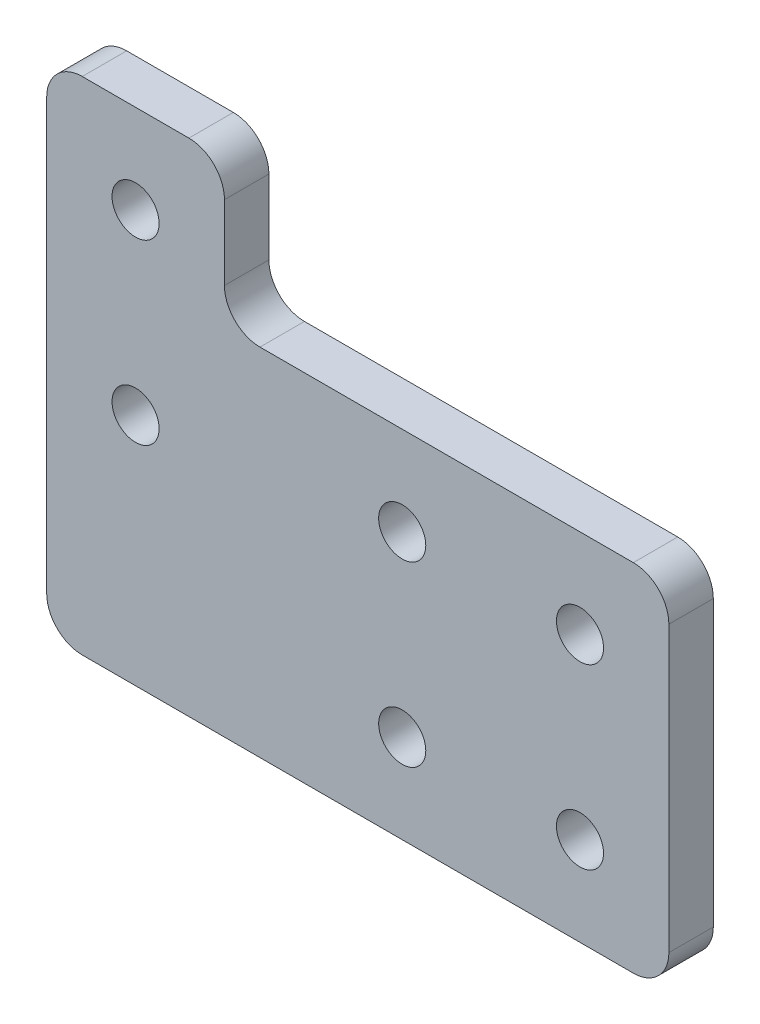
ISO-10303-21;
HEADER;
FILE_DESCRIPTION(('STEP AP214'),'2;1');
FILE_NAME('part.step','',(''),(''),'','','');
FILE_SCHEMA(('AUTOMOTIVE_DESIGN { 1 0 10303 214 1 1 1 1 }'));
ENDSEC;
DATA;
#1=APPLICATION_CONTEXT('core data for automotive mechanical design processes');
#2=APPLICATION_PROTOCOL_DEFINITION('international standard','automotive_design',2000,#1);
#3=PRODUCT_CONTEXT('',#1,'mechanical');
#4=PRODUCT('Part','Part','',(#3));
#5=PRODUCT_RELATED_PRODUCT_CATEGORY('part','',(#4));
#6=PRODUCT_DEFINITION_FORMATION('','',#4);
#7=PRODUCT_DEFINITION_CONTEXT('part definition',#1,'design');
#8=PRODUCT_DEFINITION('design','',#6,#7);
#9=PRODUCT_DEFINITION_SHAPE('','',#8);
#10=(LENGTH_UNIT() NAMED_UNIT(*) SI_UNIT(.MILLI.,.METRE.));
#11=(NAMED_UNIT(*) PLANE_ANGLE_UNIT() SI_UNIT($,.RADIAN.));
#12=(NAMED_UNIT(*) SI_UNIT($,.STERADIAN.) SOLID_ANGLE_UNIT());
#13=UNCERTAINTY_MEASURE_WITH_UNIT(LENGTH_MEASURE(1.E-05),#10,'distance_accuracy_value','');
#14=(GEOMETRIC_REPRESENTATION_CONTEXT(3) GLOBAL_UNCERTAINTY_ASSIGNED_CONTEXT((#13)) GLOBAL_UNIT_ASSIGNED_CONTEXT((#10,
#11,#12)) REPRESENTATION_CONTEXT('',''));
#15=CARTESIAN_POINT('',(0.,0.,0.));
#16=DIRECTION('',(0.,0.,1.));
#17=DIRECTION('',(1.,0.,0.));
#18=AXIS2_PLACEMENT_3D('',#15,#16,#17);
#19=CARTESIAN_POINT('',(-26.,24.,5.));
#20=DIRECTION('',(0.,0.,-1.));
#21=DIRECTION('',(-1.,0.,0.));
#22=AXIS2_PLACEMENT_3D('',#19,#20,#21);
#23=PLANE('',#22);
#24=CARTESIAN_POINT('',(-26.,24.,5.));
#25=DIRECTION('',(0.,0.,-1.));
#26=DIRECTION('',(-1.,0.,0.));
#27=AXIS2_PLACEMENT_3D('',#24,#25,#26);
#28=CIRCLE('',#27,4.00000000000001);
#29=CARTESIAN_POINT('',(-26.,20.,5.));
#30=VERTEX_POINT('',#29);
#31=CARTESIAN_POINT('',(-30.,24.,5.));
#32=VERTEX_POINT('',#31);
#33=EDGE_CURVE('E181',#30,#32,#28,.T.);
#34=ORIENTED_EDGE('',*,*,#33,.T.);
#35=DIRECTION('',(0.,1.,0.));
#36=VECTOR('',#35,1.);
#37=CARTESIAN_POINT('',(-30.,24.,5.));
#38=LINE('',#37,#36);
#39=CARTESIAN_POINT('',(-30.,32.365,5.));
#40=VERTEX_POINT('',#39);
#41=EDGE_CURVE('E108',#32,#40,#38,.T.);
#42=ORIENTED_EDGE('',*,*,#41,.T.);
#43=CARTESIAN_POINT('',(-34.,32.365,5.));
#44=DIRECTION('',(0.,0.,1.));
#45=DIRECTION('',(1.,0.,0.));
#46=AXIS2_PLACEMENT_3D('',#43,#44,#45);
#47=CIRCLE('',#46,4.00000000000001);
#48=CARTESIAN_POINT('',(-34.,36.365,5.));
#49=VERTEX_POINT('',#48);
#50=EDGE_CURVE('E208',#40,#49,#47,.T.);
#51=ORIENTED_EDGE('',*,*,#50,.T.);
#52=DIRECTION('',(-1.,0.,0.));
#53=VECTOR('',#52,1.);
#54=CARTESIAN_POINT('',(-34.,36.365,5.));
#55=LINE('',#54,#53);
#56=CARTESIAN_POINT('',(-46.,36.365,5.));
#57=VERTEX_POINT('',#56);
#58=EDGE_CURVE('E227',#49,#57,#55,.T.);
#59=ORIENTED_EDGE('',*,*,#58,.T.);
#60=CARTESIAN_POINT('',(-46.,32.365,5.));
#61=DIRECTION('',(0.,0.,1.));
#62=DIRECTION('',(1.,0.,0.));
#63=AXIS2_PLACEMENT_3D('',#60,#61,#62);
#64=CIRCLE('',#63,4.00000000000001);
#65=CARTESIAN_POINT('',(-50.,32.365,5.));
#66=VERTEX_POINT('',#65);
#67=EDGE_CURVE('E224',#57,#66,#64,.T.);
#68=ORIENTED_EDGE('',*,*,#67,.T.);
#69=DIRECTION('',(0.,-1.,0.));
#70=VECTOR('',#69,1.);
#71=CARTESIAN_POINT('',(-50.,32.365,5.));
#72=LINE('',#71,#70);
#73=CARTESIAN_POINT('',(-50.,-16.,5.));
#74=VERTEX_POINT('',#73);
#75=EDGE_CURVE('E226',#66,#74,#72,.T.);
#76=ORIENTED_EDGE('',*,*,#75,.T.);
#77=CARTESIAN_POINT('',(-46.,-16.,5.));
#78=DIRECTION('',(0.,0.,1.));
#79=DIRECTION('',(1.,0.,0.));
#80=AXIS2_PLACEMENT_3D('',#77,#78,#79);
#81=CIRCLE('',#80,4.00000000000001);
#82=CARTESIAN_POINT('',(-46.,-20.,5.));
#83=VERTEX_POINT('',#82);
#84=EDGE_CURVE('E229',#74,#83,#81,.T.);
#85=ORIENTED_EDGE('',*,*,#84,.T.);
#86=DIRECTION('',(1.,0.,0.));
#87=VECTOR('',#86,1.);
#88=CARTESIAN_POINT('',(-46.,-20.,5.));
#89=LINE('',#88,#87);
#90=CARTESIAN_POINT('',(16.,-20.,5.));
#91=VERTEX_POINT('',#90);
#92=EDGE_CURVE('E235',#83,#91,#89,.T.);
#93=ORIENTED_EDGE('',*,*,#92,.T.);
#94=CARTESIAN_POINT('',(16.,-16.,5.));
#95=DIRECTION('',(0.,0.,1.));
#96=DIRECTION('',(1.,0.,0.));
#97=AXIS2_PLACEMENT_3D('',#94,#95,#96);
#98=CIRCLE('',#97,4.);
#99=CARTESIAN_POINT('',(20.,-16.,5.));
#100=VERTEX_POINT('',#99);
#101=EDGE_CURVE('E139',#91,#100,#98,.T.);
#102=ORIENTED_EDGE('',*,*,#101,.T.);
#103=DIRECTION('',(0.,1.,0.));
#104=VECTOR('',#103,1.);
#105=CARTESIAN_POINT('',(20.,-16.,5.));
#106=LINE('',#105,#104);
#107=CARTESIAN_POINT('',(20.,16.,5.));
#108=VERTEX_POINT('',#107);
#109=EDGE_CURVE('E133',#100,#108,#106,.T.);
#110=ORIENTED_EDGE('',*,*,#109,.T.);
#111=CARTESIAN_POINT('',(16.,16.,5.));
#112=DIRECTION('',(0.,0.,1.));
#113=DIRECTION('',(1.,0.,0.));
#114=AXIS2_PLACEMENT_3D('',#111,#112,#113);
#115=CIRCLE('',#114,4.);
#116=CARTESIAN_POINT('',(16.,20.,5.));
#117=VERTEX_POINT('',#116);
#118=EDGE_CURVE('E137',#108,#117,#115,.T.);
#119=ORIENTED_EDGE('',*,*,#118,.T.);
#120=DIRECTION('',(-1.,0.,0.));
#121=VECTOR('',#120,1.);
#122=CARTESIAN_POINT('',(16.,20.,5.));
#123=LINE('',#122,#121);
#124=EDGE_CURVE('E53',#117,#30,#123,.T.);
#125=ORIENTED_EDGE('',*,*,#124,.T.);
#126=EDGE_LOOP('',(#34,#42,#51,#59,#68,#76,#85,#93,#102,#110,#119,#125));
#127=FACE_BOUND('',#126,.T.);
#128=CARTESIAN_POINT('',(-10.,10.,5.));
#129=DIRECTION('',(0.,0.,1.));
#130=DIRECTION('',(1.,0.,0.));
#131=AXIS2_PLACEMENT_3D('',#128,#129,#130);
#132=CIRCLE('',#131,2.65);
#133=CARTESIAN_POINT('',(-7.35,10.,5.));
#134=VERTEX_POINT('',#133);
#135=EDGE_CURVE('E162',#134,#134,#132,.T.);
#136=ORIENTED_EDGE('',*,*,#135,.F.);
#137=EDGE_LOOP('',(#136));
#138=FACE_BOUND('',#137,.T.);
#139=CARTESIAN_POINT('',(-10.,-10.,5.));
#140=DIRECTION('',(0.,0.,1.));
#141=DIRECTION('',(1.,0.,0.));
#142=AXIS2_PLACEMENT_3D('',#139,#140,#141);
#143=CIRCLE('',#142,2.65);
#144=CARTESIAN_POINT('',(-7.35,-10.,5.));
#145=VERTEX_POINT('',#144);
#146=EDGE_CURVE('E319',#145,#145,#143,.T.);
#147=ORIENTED_EDGE('',*,*,#146,.F.);
#148=EDGE_LOOP('',(#147));
#149=FACE_BOUND('',#148,.T.);
#150=CARTESIAN_POINT('',(10.,10.,5.));
#151=DIRECTION('',(0.,0.,1.));
#152=DIRECTION('',(1.,0.,0.));
#153=AXIS2_PLACEMENT_3D('',#150,#151,#152);
#154=CIRCLE('',#153,2.65);
#155=CARTESIAN_POINT('',(12.65,10.,5.));
#156=VERTEX_POINT('',#155);
#157=EDGE_CURVE('E313',#156,#156,#154,.T.);
#158=ORIENTED_EDGE('',*,*,#157,.F.);
#159=EDGE_LOOP('',(#158));
#160=FACE_BOUND('',#159,.T.);
#161=CARTESIAN_POINT('',(10.,-10.,5.));
#162=DIRECTION('',(0.,0.,1.));
#163=DIRECTION('',(1.,0.,0.));
#164=AXIS2_PLACEMENT_3D('',#161,#162,#163);
#165=CIRCLE('',#164,2.65000000000001);
#166=CARTESIAN_POINT('',(12.65,-10.,5.));
#167=VERTEX_POINT('',#166);
#168=EDGE_CURVE('E307',#167,#167,#165,.T.);
#169=ORIENTED_EDGE('',*,*,#168,.F.);
#170=EDGE_LOOP('',(#169));
#171=FACE_BOUND('',#170,.T.);
#172=CARTESIAN_POINT('',(-40.,26.365,5.));
#173=DIRECTION('',(0.,0.,1.));
#174=DIRECTION('',(1.,0.,0.));
#175=AXIS2_PLACEMENT_3D('',#172,#173,#174);
#176=CIRCLE('',#175,2.65);
#177=CARTESIAN_POINT('',(-37.35,26.365,5.));
#178=VERTEX_POINT('',#177);
#179=EDGE_CURVE('E301',#178,#178,#176,.T.);
#180=ORIENTED_EDGE('',*,*,#179,.F.);
#181=EDGE_LOOP('',(#180));
#182=FACE_BOUND('',#181,.T.);
#183=CARTESIAN_POINT('',(-40.,6.36499999999999,5.));
#184=DIRECTION('',(0.,0.,1.));
#185=DIRECTION('',(1.,0.,0.));
#186=AXIS2_PLACEMENT_3D('',#183,#184,#185);
#187=CIRCLE('',#186,2.65);
#188=CARTESIAN_POINT('',(-37.35,6.36499999999999,5.));
#189=VERTEX_POINT('',#188);
#190=EDGE_CURVE('E292',#189,#189,#187,.T.);
#191=ORIENTED_EDGE('',*,*,#190,.F.);
#192=EDGE_LOOP('',(#191));
#193=FACE_BOUND('',#192,.T.);
#194=ADVANCED_FACE('F36',(#127,#138,#149,#160,#171,#182,#193),#23,.F.);
#195=CARTESIAN_POINT('',(-26.,24.,0.));
#196=DIRECTION('',(0.,0.,-1.));
#197=DIRECTION('',(-1.,0.,0.));
#198=AXIS2_PLACEMENT_3D('',#195,#196,#197);
#199=PLANE('',#198);
#200=CARTESIAN_POINT('',(-40.,26.365,0.));
#201=DIRECTION('',(0.,0.,1.));
#202=DIRECTION('',(1.,0.,0.));
#203=AXIS2_PLACEMENT_3D('',#200,#201,#202);
#204=CIRCLE('',#203,2.65);
#205=CARTESIAN_POINT('',(-37.35,26.365,0.));
#206=VERTEX_POINT('',#205);
#207=EDGE_CURVE('E298',#206,#206,#204,.T.);
#208=ORIENTED_EDGE('',*,*,#207,.T.);
#209=EDGE_LOOP('',(#208));
#210=FACE_BOUND('',#209,.T.);
#211=CARTESIAN_POINT('',(10.,10.,0.));
#212=DIRECTION('',(0.,0.,1.));
#213=DIRECTION('',(1.,0.,0.));
#214=AXIS2_PLACEMENT_3D('',#211,#212,#213);
#215=CIRCLE('',#214,2.65);
#216=CARTESIAN_POINT('',(12.65,10.,0.));
#217=VERTEX_POINT('',#216);
#218=EDGE_CURVE('E310',#217,#217,#215,.T.);
#219=ORIENTED_EDGE('',*,*,#218,.T.);
#220=EDGE_LOOP('',(#219));
#221=FACE_BOUND('',#220,.T.);
#222=CARTESIAN_POINT('',(-10.,10.,0.));
#223=DIRECTION('',(0.,0.,1.));
#224=DIRECTION('',(1.,0.,0.));
#225=AXIS2_PLACEMENT_3D('',#222,#223,#224);
#226=CIRCLE('',#225,2.65);
#227=CARTESIAN_POINT('',(-7.35,10.,0.));
#228=VERTEX_POINT('',#227);
#229=EDGE_CURVE('E322',#228,#228,#226,.T.);
#230=ORIENTED_EDGE('',*,*,#229,.T.);
#231=EDGE_LOOP('',(#230));
#232=FACE_BOUND('',#231,.T.);
#233=CARTESIAN_POINT('',(-26.,24.,0.));
#234=DIRECTION('',(0.,0.,-1.));
#235=DIRECTION('',(-1.,0.,0.));
#236=AXIS2_PLACEMENT_3D('',#233,#234,#235);
#237=CIRCLE('',#236,4.00000000000001);
#238=CARTESIAN_POINT('',(-26.,20.,0.));
#239=VERTEX_POINT('',#238);
#240=CARTESIAN_POINT('',(-30.,24.,0.));
#241=VERTEX_POINT('',#240);
#242=EDGE_CURVE('E158',#239,#241,#237,.T.);
#243=ORIENTED_EDGE('',*,*,#242,.F.);
#244=DIRECTION('',(-1.,0.,0.));
#245=VECTOR('',#244,1.);
#246=CARTESIAN_POINT('',(16.,20.,0.));
#247=LINE('',#246,#245);
#248=CARTESIAN_POINT('',(16.,20.,0.));
#249=VERTEX_POINT('',#248);
#250=EDGE_CURVE('E100',#249,#239,#247,.T.);
#251=ORIENTED_EDGE('',*,*,#250,.F.);
#252=CARTESIAN_POINT('',(16.,16.,0.));
#253=DIRECTION('',(0.,0.,1.));
#254=DIRECTION('',(1.,0.,0.));
#255=AXIS2_PLACEMENT_3D('',#252,#253,#254);
#256=CIRCLE('',#255,4.);
#257=CARTESIAN_POINT('',(20.,16.,0.));
#258=VERTEX_POINT('',#257);
#259=EDGE_CURVE('E94',#258,#249,#256,.T.);
#260=ORIENTED_EDGE('',*,*,#259,.F.);
#261=DIRECTION('',(0.,1.,0.));
#262=VECTOR('',#261,1.);
#263=CARTESIAN_POINT('',(20.,-16.,0.));
#264=LINE('',#263,#262);
#265=CARTESIAN_POINT('',(20.,-16.,0.));
#266=VERTEX_POINT('',#265);
#267=EDGE_CURVE('E147',#266,#258,#264,.T.);
#268=ORIENTED_EDGE('',*,*,#267,.F.);
#269=CARTESIAN_POINT('',(16.,-16.,0.));
#270=DIRECTION('',(0.,0.,1.));
#271=DIRECTION('',(1.,0.,0.));
#272=AXIS2_PLACEMENT_3D('',#269,#270,#271);
#273=CIRCLE('',#272,4.);
#274=CARTESIAN_POINT('',(16.,-20.,0.));
#275=VERTEX_POINT('',#274);
#276=EDGE_CURVE('E176',#275,#266,#273,.T.);
#277=ORIENTED_EDGE('',*,*,#276,.F.);
#278=DIRECTION('',(1.,0.,0.));
#279=VECTOR('',#278,1.);
#280=CARTESIAN_POINT('',(-46.,-20.,0.));
#281=LINE('',#280,#279);
#282=CARTESIAN_POINT('',(-46.,-20.,0.));
#283=VERTEX_POINT('',#282);
#284=EDGE_CURVE('E174',#283,#275,#281,.T.);
#285=ORIENTED_EDGE('',*,*,#284,.F.);
#286=CARTESIAN_POINT('',(-46.,-16.,0.));
#287=DIRECTION('',(0.,0.,1.));
#288=DIRECTION('',(1.,0.,0.));
#289=AXIS2_PLACEMENT_3D('',#286,#287,#288);
#290=CIRCLE('',#289,4.00000000000001);
#291=CARTESIAN_POINT('',(-50.,-16.,0.));
#292=VERTEX_POINT('',#291);
#293=EDGE_CURVE('E172',#292,#283,#290,.T.);
#294=ORIENTED_EDGE('',*,*,#293,.F.);
#295=DIRECTION('',(0.,-1.,0.));
#296=VECTOR('',#295,1.);
#297=CARTESIAN_POINT('',(-50.,32.365,0.));
#298=LINE('',#297,#296);
#299=CARTESIAN_POINT('',(-50.,32.365,0.));
#300=VERTEX_POINT('',#299);
#301=EDGE_CURVE('E170',#300,#292,#298,.T.);
#302=ORIENTED_EDGE('',*,*,#301,.F.);
#303=CARTESIAN_POINT('',(-46.,32.365,0.));
#304=DIRECTION('',(0.,0.,1.));
#305=DIRECTION('',(1.,0.,0.));
#306=AXIS2_PLACEMENT_3D('',#303,#304,#305);
#307=CIRCLE('',#306,4.00000000000001);
#308=CARTESIAN_POINT('',(-46.,36.365,0.));
#309=VERTEX_POINT('',#308);
#310=EDGE_CURVE('E168',#309,#300,#307,.T.);
#311=ORIENTED_EDGE('',*,*,#310,.F.);
#312=DIRECTION('',(-1.,0.,0.));
#313=VECTOR('',#312,1.);
#314=CARTESIAN_POINT('',(-34.,36.365,0.));
#315=LINE('',#314,#313);
#316=CARTESIAN_POINT('',(-34.,36.365,0.));
#317=VERTEX_POINT('',#316);
#318=EDGE_CURVE('E166',#317,#309,#315,.T.);
#319=ORIENTED_EDGE('',*,*,#318,.F.);
#320=CARTESIAN_POINT('',(-34.,32.365,0.));
#321=DIRECTION('',(0.,0.,1.));
#322=DIRECTION('',(1.,0.,0.));
#323=AXIS2_PLACEMENT_3D('',#320,#321,#322);
#324=CIRCLE('',#323,4.00000000000001);
#325=CARTESIAN_POINT('',(-30.,32.365,0.));
#326=VERTEX_POINT('',#325);
#327=EDGE_CURVE('E164',#326,#317,#324,.T.);
#328=ORIENTED_EDGE('',*,*,#327,.F.);
#329=DIRECTION('',(0.,1.,0.));
#330=VECTOR('',#329,1.);
#331=CARTESIAN_POINT('',(-30.,24.,0.));
#332=LINE('',#331,#330);
#333=EDGE_CURVE('E161',#241,#326,#332,.T.);
#334=ORIENTED_EDGE('',*,*,#333,.F.);
#335=EDGE_LOOP('',(#243,#251,#260,#268,#277,#285,#294,#302,#311,#319,#328,#334));
#336=FACE_BOUND('',#335,.T.);
#337=CARTESIAN_POINT('',(-10.,-10.,0.));
#338=DIRECTION('',(0.,0.,1.));
#339=DIRECTION('',(1.,0.,0.));
#340=AXIS2_PLACEMENT_3D('',#337,#338,#339);
#341=CIRCLE('',#340,2.65);
#342=CARTESIAN_POINT('',(-7.35,-10.,0.));
#343=VERTEX_POINT('',#342);
#344=EDGE_CURVE('E316',#343,#343,#341,.T.);
#345=ORIENTED_EDGE('',*,*,#344,.T.);
#346=EDGE_LOOP('',(#345));
#347=FACE_BOUND('',#346,.T.);
#348=CARTESIAN_POINT('',(10.,-10.,0.));
#349=DIRECTION('',(0.,0.,1.));
#350=DIRECTION('',(1.,0.,0.));
#351=AXIS2_PLACEMENT_3D('',#348,#349,#350);
#352=CIRCLE('',#351,2.65000000000001);
#353=CARTESIAN_POINT('',(12.65,-10.,0.));
#354=VERTEX_POINT('',#353);
#355=EDGE_CURVE('E304',#354,#354,#352,.T.);
#356=ORIENTED_EDGE('',*,*,#355,.T.);
#357=EDGE_LOOP('',(#356));
#358=FACE_BOUND('',#357,.T.);
#359=CARTESIAN_POINT('',(-40.,6.36499999999999,0.));
#360=DIRECTION('',(0.,0.,1.));
#361=DIRECTION('',(1.,0.,0.));
#362=AXIS2_PLACEMENT_3D('',#359,#360,#361);
#363=CIRCLE('',#362,2.65);
#364=CARTESIAN_POINT('',(-37.35,6.36499999999999,0.));
#365=VERTEX_POINT('',#364);
#366=EDGE_CURVE('E295',#365,#365,#363,.T.);
#367=ORIENTED_EDGE('',*,*,#366,.T.);
#368=EDGE_LOOP('',(#367));
#369=FACE_BOUND('',#368,.T.);
#370=ADVANCED_FACE('F212',(#210,#221,#232,#336,#347,#358,#369),#199,.T.);
#371=CARTESIAN_POINT('',(-26.,24.,5.));
#372=DIRECTION('',(0.,0.,-1.));
#373=DIRECTION('',(-1.,0.,0.));
#374=AXIS2_PLACEMENT_3D('',#371,#372,#373);
#375=CYLINDRICAL_SURFACE('',#374,4.00000000000001);
#376=ORIENTED_EDGE('',*,*,#242,.T.);
#377=DIRECTION('',(0.,0.,-1.));
#378=VECTOR('',#377,1.);
#379=CARTESIAN_POINT('',(-30.,24.,5.));
#380=LINE('',#379,#378);
#381=EDGE_CURVE('E11',#32,#241,#380,.T.);
#382=ORIENTED_EDGE('',*,*,#381,.F.);
#383=ORIENTED_EDGE('',*,*,#33,.F.);
#384=DIRECTION('',(0.,0.,-1.));
#385=VECTOR('',#384,1.);
#386=CARTESIAN_POINT('',(-26.,20.,5.));
#387=LINE('',#386,#385);
#388=EDGE_CURVE('E154',#30,#239,#387,.T.);
#389=ORIENTED_EDGE('',*,*,#388,.T.);
#390=EDGE_LOOP('',(#376,#382,#383,#389));
#391=FACE_BOUND('',#390,.T.);
#392=ADVANCED_FACE('F38',(#391),#375,.F.);
#393=CARTESIAN_POINT('',(-30.,24.,5.));
#394=DIRECTION('',(-1.,0.,0.));
#395=DIRECTION('',(0.,-1.,0.));
#396=AXIS2_PLACEMENT_3D('',#393,#394,#395);
#397=PLANE('',#396);
#398=ORIENTED_EDGE('',*,*,#333,.T.);
#399=DIRECTION('',(0.,0.,-1.));
#400=VECTOR('',#399,1.);
#401=CARTESIAN_POINT('',(-30.,32.365,5.));
#402=LINE('',#401,#400);
#403=EDGE_CURVE('E45',#40,#326,#402,.T.);
#404=ORIENTED_EDGE('',*,*,#403,.F.);
#405=ORIENTED_EDGE('',*,*,#41,.F.);
#406=ORIENTED_EDGE('',*,*,#381,.T.);
#407=EDGE_LOOP('',(#398,#404,#405,#406));
#408=FACE_BOUND('',#407,.T.);
#409=ADVANCED_FACE('F452',(#408),#397,.F.);
#410=CARTESIAN_POINT('',(-34.,32.365,5.));
#411=DIRECTION('',(0.,0.,-1.));
#412=DIRECTION('',(-1.,0.,0.));
#413=AXIS2_PLACEMENT_3D('',#410,#411,#412);
#414=CYLINDRICAL_SURFACE('',#413,4.00000000000001);
#415=ORIENTED_EDGE('',*,*,#327,.T.);
#416=DIRECTION('',(0.,0.,-1.));
#417=VECTOR('',#416,1.);
#418=CARTESIAN_POINT('',(-34.,36.365,5.));
#419=LINE('',#418,#417);
#420=EDGE_CURVE('E200',#49,#317,#419,.T.);
#421=ORIENTED_EDGE('',*,*,#420,.F.);
#422=ORIENTED_EDGE('',*,*,#50,.F.);
#423=ORIENTED_EDGE('',*,*,#403,.T.);
#424=EDGE_LOOP('',(#415,#421,#422,#423));
#425=FACE_BOUND('',#424,.T.);
#426=ADVANCED_FACE('F206',(#425),#414,.T.);
#427=CARTESIAN_POINT('',(-34.,36.365,5.));
#428=DIRECTION('',(0.,-1.,0.));
#429=DIRECTION('',(0.,0.,-1.));
#430=AXIS2_PLACEMENT_3D('',#427,#428,#429);
#431=PLANE('',#430);
#432=ORIENTED_EDGE('',*,*,#318,.T.);
#433=DIRECTION('',(0.,0.,-1.));
#434=VECTOR('',#433,1.);
#435=CARTESIAN_POINT('',(-46.,36.365,5.));
#436=LINE('',#435,#434);
#437=EDGE_CURVE('E197',#57,#309,#436,.T.);
#438=ORIENTED_EDGE('',*,*,#437,.F.);
#439=ORIENTED_EDGE('',*,*,#58,.F.);
#440=ORIENTED_EDGE('',*,*,#420,.T.);
#441=EDGE_LOOP('',(#432,#438,#439,#440));
#442=FACE_BOUND('',#441,.T.);
#443=ADVANCED_FACE('F218',(#442),#431,.F.);
#444=CARTESIAN_POINT('',(-46.,32.365,5.));
#445=DIRECTION('',(0.,0.,-1.));
#446=DIRECTION('',(-1.,0.,0.));
#447=AXIS2_PLACEMENT_3D('',#444,#445,#446);
#448=CYLINDRICAL_SURFACE('',#447,4.00000000000001);
#449=ORIENTED_EDGE('',*,*,#310,.T.);
#450=DIRECTION('',(0.,0.,-1.));
#451=VECTOR('',#450,1.);
#452=CARTESIAN_POINT('',(-50.,32.365,5.));
#453=LINE('',#452,#451);
#454=EDGE_CURVE('E194',#66,#300,#453,.T.);
#455=ORIENTED_EDGE('',*,*,#454,.F.);
#456=ORIENTED_EDGE('',*,*,#67,.F.);
#457=ORIENTED_EDGE('',*,*,#437,.T.);
#458=EDGE_LOOP('',(#449,#455,#456,#457));
#459=FACE_BOUND('',#458,.T.);
#460=ADVANCED_FACE('F222',(#459),#448,.T.);
#461=CARTESIAN_POINT('',(-50.,32.365,5.));
#462=DIRECTION('',(1.,0.,0.));
#463=DIRECTION('',(0.,1.,0.));
#464=AXIS2_PLACEMENT_3D('',#461,#462,#463);
#465=PLANE('',#464);
#466=ORIENTED_EDGE('',*,*,#301,.T.);
#467=DIRECTION('',(0.,0.,-1.));
#468=VECTOR('',#467,1.);
#469=CARTESIAN_POINT('',(-50.,-16.,5.));
#470=LINE('',#469,#468);
#471=EDGE_CURVE('E191',#74,#292,#470,.T.);
#472=ORIENTED_EDGE('',*,*,#471,.F.);
#473=ORIENTED_EDGE('',*,*,#75,.F.);
#474=ORIENTED_EDGE('',*,*,#454,.T.);
#475=EDGE_LOOP('',(#466,#472,#473,#474));
#476=FACE_BOUND('',#475,.T.);
#477=ADVANCED_FACE('F417',(#476),#465,.F.);
#478=CARTESIAN_POINT('',(-46.,-16.,5.));
#479=DIRECTION('',(0.,0.,-1.));
#480=DIRECTION('',(-1.,0.,0.));
#481=AXIS2_PLACEMENT_3D('',#478,#479,#480);
#482=CYLINDRICAL_SURFACE('',#481,4.00000000000001);
#483=ORIENTED_EDGE('',*,*,#293,.T.);
#484=DIRECTION('',(0.,0.,-1.));
#485=VECTOR('',#484,1.);
#486=CARTESIAN_POINT('',(-46.,-20.,5.));
#487=LINE('',#486,#485);
#488=EDGE_CURVE('E188',#83,#283,#487,.T.);
#489=ORIENTED_EDGE('',*,*,#488,.F.);
#490=ORIENTED_EDGE('',*,*,#84,.F.);
#491=ORIENTED_EDGE('',*,*,#471,.T.);
#492=EDGE_LOOP('',(#483,#489,#490,#491));
#493=FACE_BOUND('',#492,.T.);
#494=ADVANCED_FACE('F408',(#493),#482,.T.);
#495=CARTESIAN_POINT('',(-46.,-20.,5.));
#496=DIRECTION('',(0.,1.,0.));
#497=DIRECTION('',(-1.,0.,0.));
#498=AXIS2_PLACEMENT_3D('',#495,#496,#497);
#499=PLANE('',#498);
#500=ORIENTED_EDGE('',*,*,#284,.T.);
#501=DIRECTION('',(0.,0.,-1.));
#502=VECTOR('',#501,1.);
#503=CARTESIAN_POINT('',(16.,-20.,5.));
#504=LINE('',#503,#502);
#505=EDGE_CURVE('E185',#91,#275,#504,.T.);
#506=ORIENTED_EDGE('',*,*,#505,.F.);
#507=ORIENTED_EDGE('',*,*,#92,.F.);
#508=ORIENTED_EDGE('',*,*,#488,.T.);
#509=EDGE_LOOP('',(#500,#506,#507,#508));
#510=FACE_BOUND('',#509,.T.);
#511=ADVANCED_FACE('F241',(#510),#499,.F.);
#512=CARTESIAN_POINT('',(16.,-16.,5.));
#513=DIRECTION('',(0.,0.,-1.));
#514=DIRECTION('',(-1.,0.,0.));
#515=AXIS2_PLACEMENT_3D('',#512,#513,#514);
#516=CYLINDRICAL_SURFACE('',#515,4.);
#517=ORIENTED_EDGE('',*,*,#276,.T.);
#518=DIRECTION('',(0.,0.,-1.));
#519=VECTOR('',#518,1.);
#520=CARTESIAN_POINT('',(20.,-16.,5.));
#521=LINE('',#520,#519);
#522=EDGE_CURVE('E148',#100,#266,#521,.T.);
#523=ORIENTED_EDGE('',*,*,#522,.F.);
#524=ORIENTED_EDGE('',*,*,#101,.F.);
#525=ORIENTED_EDGE('',*,*,#505,.T.);
#526=EDGE_LOOP('',(#517,#523,#524,#525));
#527=FACE_BOUND('',#526,.T.);
#528=ADVANCED_FACE('F245',(#527),#516,.T.);
#529=CARTESIAN_POINT('',(20.,-16.,5.));
#530=DIRECTION('',(-1.,0.,0.));
#531=DIRECTION('',(0.,-1.,0.));
#532=AXIS2_PLACEMENT_3D('',#529,#530,#531);
#533=PLANE('',#532);
#534=ORIENTED_EDGE('',*,*,#267,.T.);
#535=DIRECTION('',(0.,0.,-1.));
#536=VECTOR('',#535,1.);
#537=CARTESIAN_POINT('',(20.,16.,5.));
#538=LINE('',#537,#536);
#539=EDGE_CURVE('E144',#108,#258,#538,.T.);
#540=ORIENTED_EDGE('',*,*,#539,.F.);
#541=ORIENTED_EDGE('',*,*,#109,.F.);
#542=ORIENTED_EDGE('',*,*,#522,.T.);
#543=EDGE_LOOP('',(#534,#540,#541,#542));
#544=FACE_BOUND('',#543,.T.);
#545=ADVANCED_FACE('F145',(#544),#533,.F.);
#546=CARTESIAN_POINT('',(16.,16.,5.));
#547=DIRECTION('',(0.,0.,-1.));
#548=DIRECTION('',(-1.,0.,0.));
#549=AXIS2_PLACEMENT_3D('',#546,#547,#548);
#550=CYLINDRICAL_SURFACE('',#549,4.);
#551=ORIENTED_EDGE('',*,*,#259,.T.);
#552=DIRECTION('',(0.,0.,-1.));
#553=VECTOR('',#552,1.);
#554=CARTESIAN_POINT('',(16.,20.,5.));
#555=LINE('',#554,#553);
#556=EDGE_CURVE('E149',#117,#249,#555,.T.);
#557=ORIENTED_EDGE('',*,*,#556,.F.);
#558=ORIENTED_EDGE('',*,*,#118,.F.);
#559=ORIENTED_EDGE('',*,*,#539,.T.);
#560=EDGE_LOOP('',(#551,#557,#558,#559));
#561=FACE_BOUND('',#560,.T.);
#562=ADVANCED_FACE('F151',(#561),#550,.T.);
#563=CARTESIAN_POINT('',(16.,20.,5.));
#564=DIRECTION('',(0.,-1.,0.));
#565=DIRECTION('',(1.,0.,0.));
#566=AXIS2_PLACEMENT_3D('',#563,#564,#565);
#567=PLANE('',#566);
#568=ORIENTED_EDGE('',*,*,#250,.T.);
#569=ORIENTED_EDGE('',*,*,#388,.F.);
#570=ORIENTED_EDGE('',*,*,#124,.F.);
#571=ORIENTED_EDGE('',*,*,#556,.T.);
#572=EDGE_LOOP('',(#568,#569,#570,#571));
#573=FACE_BOUND('',#572,.T.);
#574=ADVANCED_FACE('F249',(#573),#567,.F.);
#575=CARTESIAN_POINT('',(-10.,10.,5.));
#576=DIRECTION('',(0.,0.,-1.));
#577=DIRECTION('',(-1.,0.,0.));
#578=AXIS2_PLACEMENT_3D('',#575,#576,#577);
#579=CYLINDRICAL_SURFACE('',#578,2.65);
#580=ORIENTED_EDGE('',*,*,#135,.T.);
#581=EDGE_LOOP('',(#580));
#582=FACE_BOUND('',#581,.T.);
#583=ORIENTED_EDGE('',*,*,#229,.F.);
#584=EDGE_LOOP('',(#583));
#585=FACE_BOUND('',#584,.T.);
#586=ADVANCED_FACE('F251',(#582,#585),#579,.F.);
#587=CARTESIAN_POINT('',(-10.,-10.,5.));
#588=DIRECTION('',(0.,0.,-1.));
#589=DIRECTION('',(-1.,0.,0.));
#590=AXIS2_PLACEMENT_3D('',#587,#588,#589);
#591=CYLINDRICAL_SURFACE('',#590,2.65);
#592=ORIENTED_EDGE('',*,*,#146,.T.);
#593=EDGE_LOOP('',(#592));
#594=FACE_BOUND('',#593,.T.);
#595=ORIENTED_EDGE('',*,*,#344,.F.);
#596=EDGE_LOOP('',(#595));
#597=FACE_BOUND('',#596,.T.);
#598=ADVANCED_FACE('F257',(#594,#597),#591,.F.);
#599=CARTESIAN_POINT('',(10.,10.,5.));
#600=DIRECTION('',(0.,0.,-1.));
#601=DIRECTION('',(-1.,0.,0.));
#602=AXIS2_PLACEMENT_3D('',#599,#600,#601);
#603=CYLINDRICAL_SURFACE('',#602,2.65);
#604=ORIENTED_EDGE('',*,*,#157,.T.);
#605=EDGE_LOOP('',(#604));
#606=FACE_BOUND('',#605,.T.);
#607=ORIENTED_EDGE('',*,*,#218,.F.);
#608=EDGE_LOOP('',(#607));
#609=FACE_BOUND('',#608,.T.);
#610=ADVANCED_FACE('F271',(#606,#609),#603,.F.);
#611=CARTESIAN_POINT('',(10.,-10.,5.));
#612=DIRECTION('',(0.,0.,-1.));
#613=DIRECTION('',(-1.,0.,0.));
#614=AXIS2_PLACEMENT_3D('',#611,#612,#613);
#615=CYLINDRICAL_SURFACE('',#614,2.65000000000001);
#616=ORIENTED_EDGE('',*,*,#168,.T.);
#617=EDGE_LOOP('',(#616));
#618=FACE_BOUND('',#617,.T.);
#619=ORIENTED_EDGE('',*,*,#355,.F.);
#620=EDGE_LOOP('',(#619));
#621=FACE_BOUND('',#620,.T.);
#622=ADVANCED_FACE('F275',(#618,#621),#615,.F.);
#623=CARTESIAN_POINT('',(-40.,26.365,5.));
#624=DIRECTION('',(0.,0.,-1.));
#625=DIRECTION('',(-1.,0.,0.));
#626=AXIS2_PLACEMENT_3D('',#623,#624,#625);
#627=CYLINDRICAL_SURFACE('',#626,2.65);
#628=ORIENTED_EDGE('',*,*,#179,.T.);
#629=EDGE_LOOP('',(#628));
#630=FACE_BOUND('',#629,.T.);
#631=ORIENTED_EDGE('',*,*,#207,.F.);
#632=EDGE_LOOP('',(#631));
#633=FACE_BOUND('',#632,.T.);
#634=ADVANCED_FACE('F279',(#630,#633),#627,.F.);
#635=CARTESIAN_POINT('',(-40.,6.36499999999999,5.));
#636=DIRECTION('',(0.,0.,-1.));
#637=DIRECTION('',(-1.,0.,0.));
#638=AXIS2_PLACEMENT_3D('',#635,#636,#637);
#639=CYLINDRICAL_SURFACE('',#638,2.65);
#640=ORIENTED_EDGE('',*,*,#190,.T.);
#641=EDGE_LOOP('',(#640));
#642=FACE_BOUND('',#641,.T.);
#643=ORIENTED_EDGE('',*,*,#366,.F.);
#644=EDGE_LOOP('',(#643));
#645=FACE_BOUND('',#644,.T.);
#646=ADVANCED_FACE('F283',(#642,#645),#639,.F.);
#647=CLOSED_SHELL('',(#194,#370,#392,#409,#426,#443,#460,#477,#494,#511,#528,#545,#562,#574,
#586,#598,#610,#622,#634,#646));
#648=MANIFOLD_SOLID_BREP('B2',#647);
#649=ADVANCED_BREP_SHAPE_REPRESENTATION('',(#18,#648),#14);
#650=SHAPE_DEFINITION_REPRESENTATION(#9,#649);
ENDSEC;
END-ISO-10303-21;
